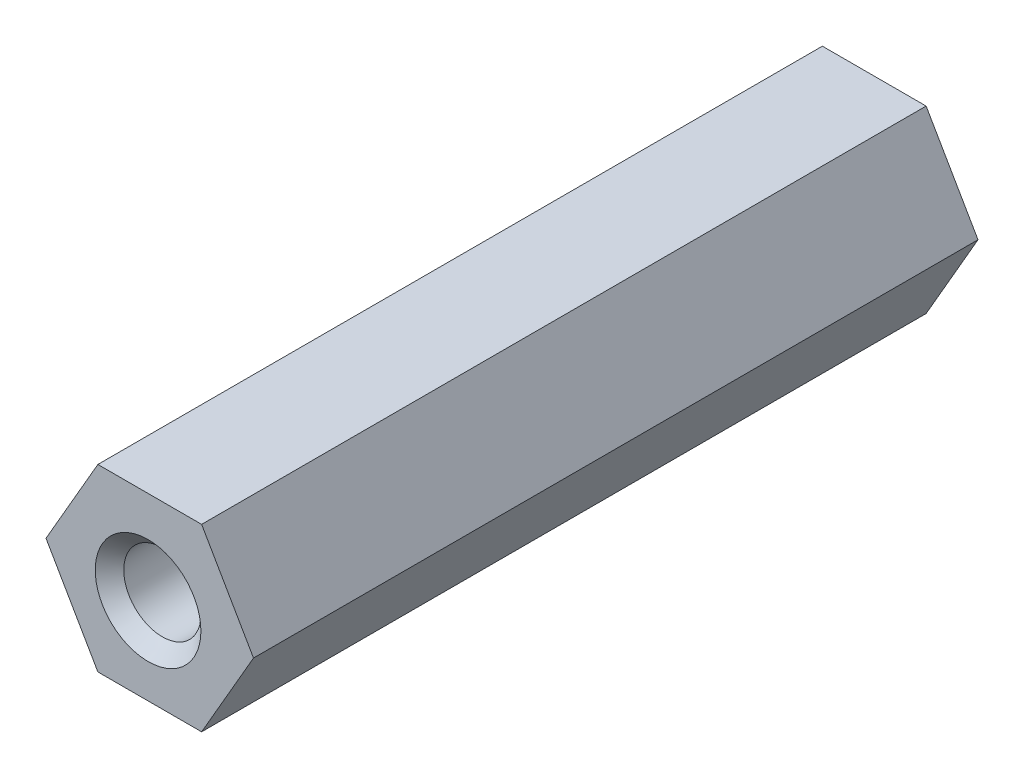
ISO-10303-21;
HEADER;
FILE_DESCRIPTION(('STEP AP214'),'2;1');
FILE_NAME('part.step','',(''),(''),'','','');
FILE_SCHEMA(('AUTOMOTIVE_DESIGN { 1 0 10303 214 1 1 1 1 }'));
ENDSEC;
DATA;
#1=APPLICATION_CONTEXT('core data for automotive mechanical design processes');
#2=APPLICATION_PROTOCOL_DEFINITION('international standard','automotive_design',2000,#1);
#3=PRODUCT_CONTEXT('',#1,'mechanical');
#4=PRODUCT('Part','Part','',(#3));
#5=PRODUCT_RELATED_PRODUCT_CATEGORY('part','',(#4));
#6=PRODUCT_DEFINITION_FORMATION('','',#4);
#7=PRODUCT_DEFINITION_CONTEXT('part definition',#1,'design');
#8=PRODUCT_DEFINITION('design','',#6,#7);
#9=PRODUCT_DEFINITION_SHAPE('','',#8);
#10=(LENGTH_UNIT() NAMED_UNIT(*) SI_UNIT(.MILLI.,.METRE.));
#11=(NAMED_UNIT(*) PLANE_ANGLE_UNIT() SI_UNIT($,.RADIAN.));
#12=(NAMED_UNIT(*) SI_UNIT($,.STERADIAN.) SOLID_ANGLE_UNIT());
#13=UNCERTAINTY_MEASURE_WITH_UNIT(LENGTH_MEASURE(1.E-05),#10,'distance_accuracy_value','');
#14=(GEOMETRIC_REPRESENTATION_CONTEXT(3) GLOBAL_UNCERTAINTY_ASSIGNED_CONTEXT((#13)) GLOBAL_UNIT_ASSIGNED_CONTEXT((#10,
#11,#12)) REPRESENTATION_CONTEXT('',''));
#15=CARTESIAN_POINT('',(0.,0.,0.));
#16=DIRECTION('',(0.,0.,1.));
#17=DIRECTION('',(1.,0.,0.));
#18=AXIS2_PLACEMENT_3D('',#15,#16,#17);
#19=CARTESIAN_POINT('',(3.63730669589464,0.,-12.7));
#20=DIRECTION('',(0.,0.,1.));
#21=DIRECTION('',(1.,0.,0.));
#22=AXIS2_PLACEMENT_3D('',#19,#20,#21);
#23=PLANE('',#22);
#24=DIRECTION('',(0.5,0.866025403784438,0.));
#25=VECTOR('',#24,1.);
#26=CARTESIAN_POINT('',(1.81865334794732,-3.15,-12.7));
#27=LINE('',#26,#25);
#28=CARTESIAN_POINT('',(1.81865334794732,-3.15,-12.7));
#29=VERTEX_POINT('',#28);
#30=CARTESIAN_POINT('',(3.63730669589464,0.,-12.7));
#31=VERTEX_POINT('',#30);
#32=EDGE_CURVE('E150',#29,#31,#27,.T.);
#33=ORIENTED_EDGE('',*,*,#32,.F.);
#34=DIRECTION('',(1.,0.,0.));
#35=VECTOR('',#34,1.);
#36=CARTESIAN_POINT('',(-1.81865334794732,-3.15,-12.7));
#37=LINE('',#36,#35);
#38=CARTESIAN_POINT('',(-1.81865334794732,-3.15,-12.7));
#39=VERTEX_POINT('',#38);
#40=EDGE_CURVE('E113',#39,#29,#37,.T.);
#41=ORIENTED_EDGE('',*,*,#40,.F.);
#42=DIRECTION('',(0.5,-0.866025403784439,0.));
#43=VECTOR('',#42,1.);
#44=CARTESIAN_POINT('',(-3.63730669589464,0.,-12.7));
#45=LINE('',#44,#43);
#46=CARTESIAN_POINT('',(-3.63730669589464,0.,-12.7));
#47=VERTEX_POINT('',#46);
#48=EDGE_CURVE('E97',#47,#39,#45,.T.);
#49=ORIENTED_EDGE('',*,*,#48,.F.);
#50=DIRECTION('',(-0.5,-0.866025403784438,0.));
#51=VECTOR('',#50,1.);
#52=CARTESIAN_POINT('',(-1.81865334794732,3.15,-12.7));
#53=LINE('',#52,#51);
#54=CARTESIAN_POINT('',(-1.81865334794732,3.15,-12.7));
#55=VERTEX_POINT('',#54);
#56=EDGE_CURVE('E111',#55,#47,#53,.T.);
#57=ORIENTED_EDGE('',*,*,#56,.F.);
#58=DIRECTION('',(-1.,0.,0.));
#59=VECTOR('',#58,1.);
#60=CARTESIAN_POINT('',(1.81865334794732,3.15,-12.7));
#61=LINE('',#60,#59);
#62=CARTESIAN_POINT('',(1.81865334794732,3.15,-12.7));
#63=VERTEX_POINT('',#62);
#64=EDGE_CURVE('E118',#63,#55,#61,.T.);
#65=ORIENTED_EDGE('',*,*,#64,.F.);
#66=DIRECTION('',(-0.5,0.866025403784438,0.));
#67=VECTOR('',#66,1.);
#68=CARTESIAN_POINT('',(3.63730669589464,0.,-12.7));
#69=LINE('',#68,#67);
#70=EDGE_CURVE('E123',#31,#63,#69,.T.);
#71=ORIENTED_EDGE('',*,*,#70,.F.);
#72=EDGE_LOOP('',(#33,#41,#49,#57,#65,#71));
#73=FACE_BOUND('',#72,.T.);
#74=CARTESIAN_POINT('',(-0.0587533379232065,-0.101763766397256,-12.7));
#75=DIRECTION('',(0.,0.,1.));
#76=DIRECTION('',(1.,0.,0.));
#77=AXIS2_PLACEMENT_3D('',#74,#75,#76);
#78=CIRCLE('',#77,1.85254999999999);
#79=CARTESIAN_POINT('',(1.79379666207679,-0.101763766397256,-12.7));
#80=VERTEX_POINT('',#79);
#81=EDGE_CURVE('E346',#80,#80,#78,.T.);
#82=ORIENTED_EDGE('',*,*,#81,.T.);
#83=EDGE_LOOP('',(#82));
#84=FACE_BOUND('',#83,.T.);
#85=ADVANCED_FACE('F16',(#73,#84),#23,.F.);
#86=CARTESIAN_POINT('',(3.63730669589464,0.,12.7));
#87=DIRECTION('',(0.,0.,1.));
#88=DIRECTION('',(1.,0.,0.));
#89=AXIS2_PLACEMENT_3D('',#86,#87,#88);
#90=PLANE('',#89);
#91=DIRECTION('',(0.5,0.866025403784438,0.));
#92=VECTOR('',#91,1.);
#93=CARTESIAN_POINT('',(1.81865334794732,-3.15,12.7));
#94=LINE('',#93,#92);
#95=CARTESIAN_POINT('',(1.81865334794732,-3.15,12.7));
#96=VERTEX_POINT('',#95);
#97=CARTESIAN_POINT('',(3.63730669589464,0.,12.7));
#98=VERTEX_POINT('',#97);
#99=EDGE_CURVE('E129',#96,#98,#94,.T.);
#100=ORIENTED_EDGE('',*,*,#99,.T.);
#101=DIRECTION('',(-0.5,0.866025403784438,0.));
#102=VECTOR('',#101,1.);
#103=CARTESIAN_POINT('',(3.63730669589464,0.,12.7));
#104=LINE('',#103,#102);
#105=CARTESIAN_POINT('',(1.81865334794732,3.15,12.7));
#106=VERTEX_POINT('',#105);
#107=EDGE_CURVE('E133',#98,#106,#104,.T.);
#108=ORIENTED_EDGE('',*,*,#107,.T.);
#109=DIRECTION('',(-1.,0.,0.));
#110=VECTOR('',#109,1.);
#111=CARTESIAN_POINT('',(1.81865334794732,3.15,12.7));
#112=LINE('',#111,#110);
#113=CARTESIAN_POINT('',(-1.81865334794732,3.15,12.7));
#114=VERTEX_POINT('',#113);
#115=EDGE_CURVE('E138',#106,#114,#112,.T.);
#116=ORIENTED_EDGE('',*,*,#115,.T.);
#117=DIRECTION('',(-0.5,-0.866025403784438,0.));
#118=VECTOR('',#117,1.);
#119=CARTESIAN_POINT('',(-1.81865334794732,3.15,12.7));
#120=LINE('',#119,#118);
#121=CARTESIAN_POINT('',(-3.63730669589464,0.,12.7));
#122=VERTEX_POINT('',#121);
#123=EDGE_CURVE('E142',#114,#122,#120,.T.);
#124=ORIENTED_EDGE('',*,*,#123,.T.);
#125=DIRECTION('',(0.5,-0.866025403784439,0.));
#126=VECTOR('',#125,1.);
#127=CARTESIAN_POINT('',(-3.63730669589464,0.,12.7));
#128=LINE('',#127,#126);
#129=CARTESIAN_POINT('',(-1.81865334794732,-3.15,12.7));
#130=VERTEX_POINT('',#129);
#131=EDGE_CURVE('E99',#122,#130,#128,.T.);
#132=ORIENTED_EDGE('',*,*,#131,.T.);
#133=DIRECTION('',(1.,0.,0.));
#134=VECTOR('',#133,1.);
#135=CARTESIAN_POINT('',(-1.81865334794732,-3.15,12.7));
#136=LINE('',#135,#134);
#137=EDGE_CURVE('E147',#130,#96,#136,.T.);
#138=ORIENTED_EDGE('',*,*,#137,.T.);
#139=EDGE_LOOP('',(#100,#108,#116,#124,#132,#138));
#140=FACE_BOUND('',#139,.T.);
#141=CARTESIAN_POINT('',(-0.0587533379232065,-0.101763766397256,12.7));
#142=DIRECTION('',(0.,0.,1.));
#143=DIRECTION('',(1.,0.,0.));
#144=AXIS2_PLACEMENT_3D('',#141,#142,#143);
#145=CIRCLE('',#144,1.85254999999998);
#146=CARTESIAN_POINT('',(1.79379666207678,-0.101763766397256,12.7));
#147=VERTEX_POINT('',#146);
#148=EDGE_CURVE('E207',#147,#147,#145,.F.);
#149=ORIENTED_EDGE('',*,*,#148,.T.);
#150=EDGE_LOOP('',(#149));
#151=FACE_BOUND('',#150,.T.);
#152=ADVANCED_FACE('F163',(#140,#151),#90,.T.);
#153=CARTESIAN_POINT('',(1.81865334794732,-3.15,-12.7));
#154=DIRECTION('',(0.866025403784439,-0.5,0.));
#155=DIRECTION('',(0.5,0.866025403784439,0.));
#156=AXIS2_PLACEMENT_3D('',#153,#154,#155);
#157=PLANE('',#156);
#158=ORIENTED_EDGE('',*,*,#99,.F.);
#159=DIRECTION('',(0.,0.,1.));
#160=VECTOR('',#159,1.);
#161=CARTESIAN_POINT('',(1.81865334794732,-3.15,-12.7));
#162=LINE('',#161,#160);
#163=EDGE_CURVE('E10',#29,#96,#162,.T.);
#164=ORIENTED_EDGE('',*,*,#163,.F.);
#165=ORIENTED_EDGE('',*,*,#32,.T.);
#166=DIRECTION('',(0.,0.,1.));
#167=VECTOR('',#166,1.);
#168=CARTESIAN_POINT('',(3.63730669589464,0.,-12.7));
#169=LINE('',#168,#167);
#170=EDGE_CURVE('E20',#31,#98,#169,.T.);
#171=ORIENTED_EDGE('',*,*,#170,.T.);
#172=EDGE_LOOP('',(#158,#164,#165,#171));
#173=FACE_BOUND('',#172,.T.);
#174=ADVANCED_FACE('F18',(#173),#157,.T.);
#175=CARTESIAN_POINT('',(-1.81865334794732,-3.15,-12.7));
#176=DIRECTION('',(0.,-1.,0.));
#177=DIRECTION('',(1.,0.,0.));
#178=AXIS2_PLACEMENT_3D('',#175,#176,#177);
#179=PLANE('',#178);
#180=ORIENTED_EDGE('',*,*,#137,.F.);
#181=DIRECTION('',(0.,0.,1.));
#182=VECTOR('',#181,1.);
#183=CARTESIAN_POINT('',(-1.81865334794732,-3.15,-12.7));
#184=LINE('',#183,#182);
#185=EDGE_CURVE('E27',#39,#130,#184,.T.);
#186=ORIENTED_EDGE('',*,*,#185,.F.);
#187=ORIENTED_EDGE('',*,*,#40,.T.);
#188=ORIENTED_EDGE('',*,*,#163,.T.);
#189=EDGE_LOOP('',(#180,#186,#187,#188));
#190=FACE_BOUND('',#189,.T.);
#191=ADVANCED_FACE('F165',(#190),#179,.T.);
#192=CARTESIAN_POINT('',(-3.63730669589464,0.,-12.7));
#193=DIRECTION('',(-0.866025403784439,-0.5,0.));
#194=DIRECTION('',(0.5,-0.866025403784439,0.));
#195=AXIS2_PLACEMENT_3D('',#192,#193,#194);
#196=PLANE('',#195);
#197=ORIENTED_EDGE('',*,*,#131,.F.);
#198=DIRECTION('',(0.,0.,1.));
#199=VECTOR('',#198,1.);
#200=CARTESIAN_POINT('',(-3.63730669589464,0.,-12.7));
#201=LINE('',#200,#199);
#202=EDGE_CURVE('E94',#47,#122,#201,.T.);
#203=ORIENTED_EDGE('',*,*,#202,.F.);
#204=ORIENTED_EDGE('',*,*,#48,.T.);
#205=ORIENTED_EDGE('',*,*,#185,.T.);
#206=EDGE_LOOP('',(#197,#203,#204,#205));
#207=FACE_BOUND('',#206,.T.);
#208=ADVANCED_FACE('F96',(#207),#196,.T.);
#209=CARTESIAN_POINT('',(-1.81865334794732,3.15,-12.7));
#210=DIRECTION('',(-0.866025403784439,0.5,0.));
#211=DIRECTION('',(-0.5,-0.866025403784439,0.));
#212=AXIS2_PLACEMENT_3D('',#209,#210,#211);
#213=PLANE('',#212);
#214=ORIENTED_EDGE('',*,*,#123,.F.);
#215=DIRECTION('',(0.,0.,1.));
#216=VECTOR('',#215,1.);
#217=CARTESIAN_POINT('',(-1.81865334794732,3.15,-12.7));
#218=LINE('',#217,#216);
#219=EDGE_CURVE('E105',#55,#114,#218,.T.);
#220=ORIENTED_EDGE('',*,*,#219,.F.);
#221=ORIENTED_EDGE('',*,*,#56,.T.);
#222=ORIENTED_EDGE('',*,*,#202,.T.);
#223=EDGE_LOOP('',(#214,#220,#221,#222));
#224=FACE_BOUND('',#223,.T.);
#225=ADVANCED_FACE('F116',(#224),#213,.T.);
#226=CARTESIAN_POINT('',(1.81865334794732,3.15,-12.7));
#227=DIRECTION('',(0.,1.,0.));
#228=DIRECTION('',(0.,0.,1.));
#229=AXIS2_PLACEMENT_3D('',#226,#227,#228);
#230=PLANE('',#229);
#231=ORIENTED_EDGE('',*,*,#115,.F.);
#232=DIRECTION('',(0.,0.,1.));
#233=VECTOR('',#232,1.);
#234=CARTESIAN_POINT('',(1.81865334794732,3.15,-12.7));
#235=LINE('',#234,#233);
#236=EDGE_CURVE('E155',#63,#106,#235,.T.);
#237=ORIENTED_EDGE('',*,*,#236,.F.);
#238=ORIENTED_EDGE('',*,*,#64,.T.);
#239=ORIENTED_EDGE('',*,*,#219,.T.);
#240=EDGE_LOOP('',(#231,#237,#238,#239));
#241=FACE_BOUND('',#240,.T.);
#242=ADVANCED_FACE('F215',(#241),#230,.T.);
#243=CARTESIAN_POINT('',(3.63730669589464,0.,-12.7));
#244=DIRECTION('',(0.866025403784438,0.5,0.));
#245=DIRECTION('',(-0.5,0.866025403784438,0.));
#246=AXIS2_PLACEMENT_3D('',#243,#244,#245);
#247=PLANE('',#246);
#248=ORIENTED_EDGE('',*,*,#107,.F.);
#249=ORIENTED_EDGE('',*,*,#170,.F.);
#250=ORIENTED_EDGE('',*,*,#70,.T.);
#251=ORIENTED_EDGE('',*,*,#236,.T.);
#252=EDGE_LOOP('',(#248,#249,#250,#251));
#253=FACE_BOUND('',#252,.T.);
#254=ADVANCED_FACE('F161',(#253),#247,.T.);
#255=CARTESIAN_POINT('',(-0.0587533379232065,-0.101763766397256,12.2));
#256=DIRECTION('',(0.,0.,1.));
#257=DIRECTION('',(1.,0.,0.));
#258=AXIS2_PLACEMENT_3D('',#255,#256,#257);
#259=CONICAL_SURFACE('',#258,1.35254999999999,0.78539816339745);
#260=ORIENTED_EDGE('',*,*,#148,.F.);
#261=EDGE_LOOP('',(#260));
#262=FACE_BOUND('',#261,.T.);
#263=CARTESIAN_POINT('',(-0.0587533379232065,-0.101763766397256,12.2));
#264=DIRECTION('',(0.,0.,1.));
#265=DIRECTION('',(1.,0.,0.));
#266=AXIS2_PLACEMENT_3D('',#263,#264,#265);
#267=CIRCLE('',#266,1.35254999999999);
#268=CARTESIAN_POINT('',(1.29379666207678,-0.101763766397256,12.2));
#269=VERTEX_POINT('',#268);
#270=EDGE_CURVE('E134',#269,#269,#267,.T.);
#271=ORIENTED_EDGE('',*,*,#270,.F.);
#272=EDGE_LOOP('',(#271));
#273=FACE_BOUND('',#272,.T.);
#274=ADVANCED_FACE('F181',(#262,#273),#259,.F.);
#275=CARTESIAN_POINT('',(-0.0587533379232065,-0.101763766397256,-12.7));
#276=DIRECTION('',(0.,0.,-1.));
#277=DIRECTION('',(-1.,0.,0.));
#278=AXIS2_PLACEMENT_3D('',#275,#276,#277);
#279=CONICAL_SURFACE('',#278,1.85254999999999,0.785398163397447);
#280=CARTESIAN_POINT('',(-0.0587533379232065,-0.101763766397256,-12.2));
#281=DIRECTION('',(0.,0.,1.));
#282=DIRECTION('',(1.,0.,0.));
#283=AXIS2_PLACEMENT_3D('',#280,#281,#282);
#284=CIRCLE('',#283,1.35254999999999);
#285=CARTESIAN_POINT('',(1.29379666207678,-0.101763766397256,-12.2));
#286=VERTEX_POINT('',#285);
#287=EDGE_CURVE('E197',#286,#286,#284,.F.);
#288=ORIENTED_EDGE('',*,*,#287,.F.);
#289=EDGE_LOOP('',(#288));
#290=FACE_BOUND('',#289,.T.);
#291=ORIENTED_EDGE('',*,*,#81,.F.);
#292=EDGE_LOOP('',(#291));
#293=FACE_BOUND('',#292,.T.);
#294=ADVANCED_FACE('F184',(#290,#293),#279,.F.);
#295=CARTESIAN_POINT('',(-0.0587533379232065,-0.101763766397256,12.7));
#296=DIRECTION('',(0.,0.,1.));
#297=DIRECTION('',(1.,0.,0.));
#298=AXIS2_PLACEMENT_3D('',#295,#296,#297);
#299=CYLINDRICAL_SURFACE('',#298,1.35254999999999);
#300=ORIENTED_EDGE('',*,*,#287,.T.);
#301=EDGE_LOOP('',(#300));
#302=FACE_BOUND('',#301,.T.);
#303=ORIENTED_EDGE('',*,*,#270,.T.);
#304=EDGE_LOOP('',(#303));
#305=FACE_BOUND('',#304,.T.);
#306=ADVANCED_FACE('F188',(#302,#305),#299,.F.);
#307=CLOSED_SHELL('',(#85,#152,#174,#191,#208,#225,#242,#254,#274,#294,#306));
#308=MANIFOLD_SOLID_BREP('B1',#307);
#309=ADVANCED_BREP_SHAPE_REPRESENTATION('',(#18,#308),#14);
#310=SHAPE_DEFINITION_REPRESENTATION(#9,#309);
ENDSEC;
END-ISO-10303-21;
